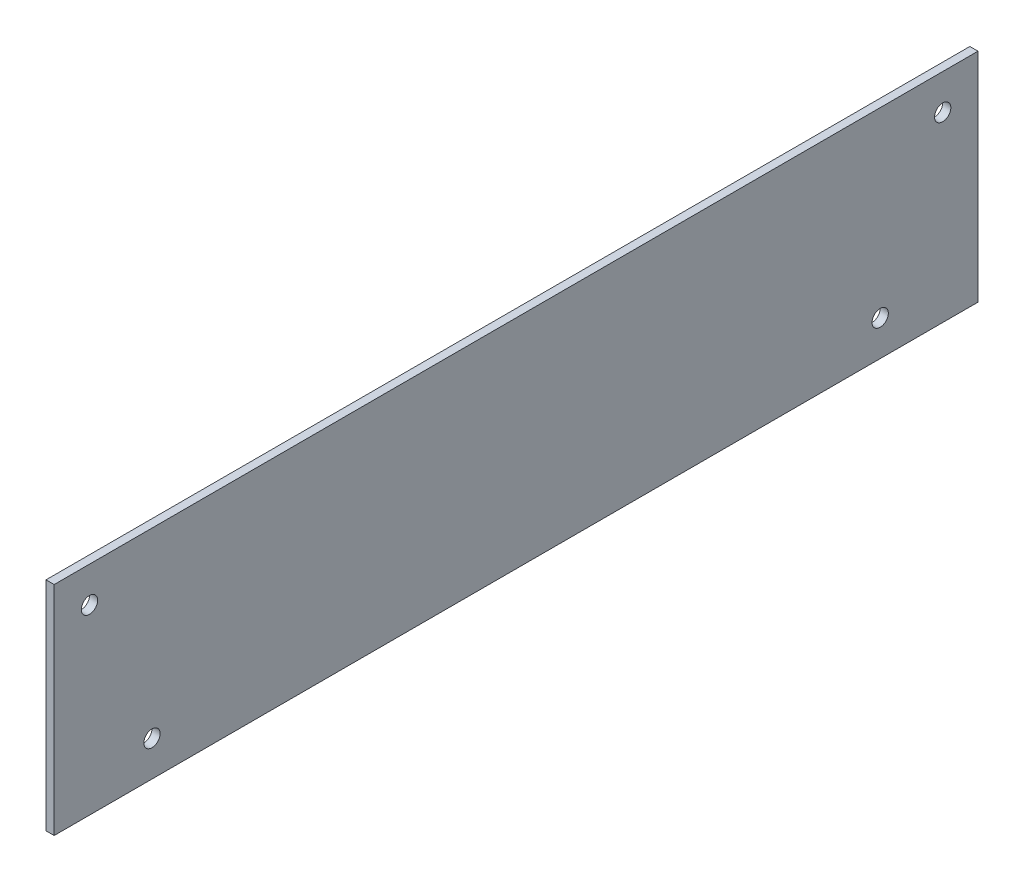
ISO-10303-21;
HEADER;
FILE_DESCRIPTION(('STEP AP214'),'2;1');
FILE_NAME('part.step','',(''),(''),'','','');
FILE_SCHEMA(('AUTOMOTIVE_DESIGN { 1 0 10303 214 1 1 1 1 }'));
ENDSEC;
DATA;
#1=APPLICATION_CONTEXT('core data for automotive mechanical design processes');
#2=APPLICATION_PROTOCOL_DEFINITION('international standard','automotive_design',2000,#1);
#3=PRODUCT_CONTEXT('',#1,'mechanical');
#4=PRODUCT('Part','Part','',(#3));
#5=PRODUCT_RELATED_PRODUCT_CATEGORY('part','',(#4));
#6=PRODUCT_DEFINITION_FORMATION('','',#4);
#7=PRODUCT_DEFINITION_CONTEXT('part definition',#1,'design');
#8=PRODUCT_DEFINITION('design','',#6,#7);
#9=PRODUCT_DEFINITION_SHAPE('','',#8);
#10=(LENGTH_UNIT() NAMED_UNIT(*) SI_UNIT(.MILLI.,.METRE.));
#11=(NAMED_UNIT(*) PLANE_ANGLE_UNIT() SI_UNIT($,.RADIAN.));
#12=(NAMED_UNIT(*) SI_UNIT($,.STERADIAN.) SOLID_ANGLE_UNIT());
#13=UNCERTAINTY_MEASURE_WITH_UNIT(LENGTH_MEASURE(1.E-05),#10,'distance_accuracy_value','');
#14=(GEOMETRIC_REPRESENTATION_CONTEXT(3) GLOBAL_UNCERTAINTY_ASSIGNED_CONTEXT((#13)) GLOBAL_UNIT_ASSIGNED_CONTEXT((#10,
#11,#12)) REPRESENTATION_CONTEXT('',''));
#15=CARTESIAN_POINT('',(0.,0.,0.));
#16=DIRECTION('',(0.,0.,1.));
#17=DIRECTION('',(1.,0.,0.));
#18=AXIS2_PLACEMENT_3D('',#15,#16,#17);
#19=CARTESIAN_POINT('',(1.5,0.,0.));
#20=DIRECTION('',(-1.,0.,0.));
#21=DIRECTION('',(0.,0.,1.));
#22=AXIS2_PLACEMENT_3D('',#19,#20,#21);
#23=PLANE('',#22);
#24=CARTESIAN_POINT('',(1.5,33.5,-163.5));
#25=DIRECTION('',(-1.,0.,0.));
#26=DIRECTION('',(0.,0.,1.));
#27=AXIS2_PLACEMENT_3D('',#24,#25,#26);
#28=CIRCLE('',#27,1.5);
#29=CARTESIAN_POINT('',(1.5,33.5,-162.));
#30=VERTEX_POINT('',#29);
#31=EDGE_CURVE('E114',#30,#30,#28,.F.);
#32=ORIENTED_EDGE('',*,*,#31,.F.);
#33=EDGE_LOOP('',(#32));
#34=FACE_BOUND('',#33,.T.);
#35=CARTESIAN_POINT('',(1.5,6.5,-18.));
#36=DIRECTION('',(-1.,0.,0.));
#37=DIRECTION('',(0.,0.,1.));
#38=AXIS2_PLACEMENT_3D('',#35,#36,#37);
#39=CIRCLE('',#38,1.5);
#40=CARTESIAN_POINT('',(1.5,6.5,-16.5));
#41=VERTEX_POINT('',#40);
#42=EDGE_CURVE('E102',#41,#41,#39,.F.);
#43=ORIENTED_EDGE('',*,*,#42,.F.);
#44=EDGE_LOOP('',(#43));
#45=FACE_BOUND('',#44,.T.);
#46=DIRECTION('',(0.,-1.,0.));
#47=VECTOR('',#46,1.);
#48=CARTESIAN_POINT('',(1.5,0.,0.));
#49=LINE('',#48,#47);
#50=CARTESIAN_POINT('',(1.5,40.,0.));
#51=VERTEX_POINT('',#50);
#52=CARTESIAN_POINT('',(1.5,0.,0.));
#53=VERTEX_POINT('',#52);
#54=EDGE_CURVE('E86',#51,#53,#49,.T.);
#55=ORIENTED_EDGE('',*,*,#54,.T.);
#56=DIRECTION('',(0.,0.,-1.));
#57=VECTOR('',#56,1.);
#58=CARTESIAN_POINT('',(1.5,0.,0.));
#59=LINE('',#58,#57);
#60=CARTESIAN_POINT('',(1.5,0.,-170.));
#61=VERTEX_POINT('',#60);
#62=EDGE_CURVE('E81',#53,#61,#59,.T.);
#63=ORIENTED_EDGE('',*,*,#62,.T.);
#64=DIRECTION('',(0.,1.,0.));
#65=VECTOR('',#64,1.);
#66=CARTESIAN_POINT('',(1.5,0.,-170.));
#67=LINE('',#66,#65);
#68=CARTESIAN_POINT('',(1.5,40.,-170.));
#69=VERTEX_POINT('',#68);
#70=EDGE_CURVE('E84',#61,#69,#67,.T.);
#71=ORIENTED_EDGE('',*,*,#70,.T.);
#72=DIRECTION('',(0.,0.,1.));
#73=VECTOR('',#72,1.);
#74=CARTESIAN_POINT('',(1.5,40.,0.));
#75=LINE('',#74,#73);
#76=EDGE_CURVE('E51',#69,#51,#75,.T.);
#77=ORIENTED_EDGE('',*,*,#76,.T.);
#78=EDGE_LOOP('',(#55,#63,#71,#77));
#79=FACE_BOUND('',#78,.T.);
#80=CARTESIAN_POINT('',(1.5,6.5,-152.));
#81=DIRECTION('',(-1.,0.,0.));
#82=DIRECTION('',(0.,0.,1.));
#83=AXIS2_PLACEMENT_3D('',#80,#81,#82);
#84=CIRCLE('',#83,1.5);
#85=CARTESIAN_POINT('',(1.5,6.5,-150.5));
#86=VERTEX_POINT('',#85);
#87=EDGE_CURVE('E111',#86,#86,#84,.F.);
#88=ORIENTED_EDGE('',*,*,#87,.F.);
#89=EDGE_LOOP('',(#88));
#90=FACE_BOUND('',#89,.T.);
#91=CARTESIAN_POINT('',(1.5,33.5,-6.5));
#92=DIRECTION('',(-1.,0.,0.));
#93=DIRECTION('',(0.,0.,1.));
#94=AXIS2_PLACEMENT_3D('',#91,#92,#93);
#95=CIRCLE('',#94,1.5);
#96=CARTESIAN_POINT('',(1.5,33.5,-5.));
#97=VERTEX_POINT('',#96);
#98=EDGE_CURVE('E117',#97,#97,#95,.F.);
#99=ORIENTED_EDGE('',*,*,#98,.F.);
#100=EDGE_LOOP('',(#99));
#101=FACE_BOUND('',#100,.T.);
#102=ADVANCED_FACE('F32',(#34,#45,#79,#90,#101),#23,.F.);
#103=CARTESIAN_POINT('',(0.,0.,0.));
#104=DIRECTION('',(-1.,0.,0.));
#105=DIRECTION('',(0.,0.,1.));
#106=AXIS2_PLACEMENT_3D('',#103,#104,#105);
#107=PLANE('',#106);
#108=CARTESIAN_POINT('',(0.,33.5,-163.5));
#109=DIRECTION('',(-1.,0.,0.));
#110=DIRECTION('',(0.,0.,1.));
#111=AXIS2_PLACEMENT_3D('',#108,#109,#110);
#112=CIRCLE('',#111,1.5);
#113=CARTESIAN_POINT('',(0.,33.5,-162.));
#114=VERTEX_POINT('',#113);
#115=EDGE_CURVE('E115',#114,#114,#112,.F.);
#116=ORIENTED_EDGE('',*,*,#115,.T.);
#117=EDGE_LOOP('',(#116));
#118=FACE_BOUND('',#117,.T.);
#119=CARTESIAN_POINT('',(0.,6.5,-18.));
#120=DIRECTION('',(-1.,0.,0.));
#121=DIRECTION('',(0.,0.,1.));
#122=AXIS2_PLACEMENT_3D('',#119,#120,#121);
#123=CIRCLE('',#122,1.5);
#124=CARTESIAN_POINT('',(0.,6.5,-16.5));
#125=VERTEX_POINT('',#124);
#126=EDGE_CURVE('E108',#125,#125,#123,.F.);
#127=ORIENTED_EDGE('',*,*,#126,.T.);
#128=EDGE_LOOP('',(#127));
#129=FACE_BOUND('',#128,.T.);
#130=DIRECTION('',(0.,-1.,0.));
#131=VECTOR('',#130,1.);
#132=CARTESIAN_POINT('',(0.,0.,0.));
#133=LINE('',#132,#131);
#134=CARTESIAN_POINT('',(0.,40.,0.));
#135=VERTEX_POINT('',#134);
#136=CARTESIAN_POINT('',(0.,0.,0.));
#137=VERTEX_POINT('',#136);
#138=EDGE_CURVE('E99',#135,#137,#133,.T.);
#139=ORIENTED_EDGE('',*,*,#138,.F.);
#140=DIRECTION('',(0.,0.,1.));
#141=VECTOR('',#140,1.);
#142=CARTESIAN_POINT('',(0.,40.,0.));
#143=LINE('',#142,#141);
#144=CARTESIAN_POINT('',(0.,40.,-170.));
#145=VERTEX_POINT('',#144);
#146=EDGE_CURVE('E74',#145,#135,#143,.T.);
#147=ORIENTED_EDGE('',*,*,#146,.F.);
#148=DIRECTION('',(0.,1.,0.));
#149=VECTOR('',#148,1.);
#150=CARTESIAN_POINT('',(0.,0.,-170.));
#151=LINE('',#150,#149);
#152=CARTESIAN_POINT('',(0.,0.,-170.));
#153=VERTEX_POINT('',#152);
#154=EDGE_CURVE('E68',#153,#145,#151,.T.);
#155=ORIENTED_EDGE('',*,*,#154,.F.);
#156=DIRECTION('',(0.,0.,-1.));
#157=VECTOR('',#156,1.);
#158=CARTESIAN_POINT('',(0.,0.,0.));
#159=LINE('',#158,#157);
#160=EDGE_CURVE('E90',#137,#153,#159,.T.);
#161=ORIENTED_EDGE('',*,*,#160,.F.);
#162=EDGE_LOOP('',(#139,#147,#155,#161));
#163=FACE_BOUND('',#162,.T.);
#164=CARTESIAN_POINT('',(0.,6.5,-152.));
#165=DIRECTION('',(-1.,0.,0.));
#166=DIRECTION('',(0.,0.,1.));
#167=AXIS2_PLACEMENT_3D('',#164,#165,#166);
#168=CIRCLE('',#167,1.5);
#169=CARTESIAN_POINT('',(0.,6.5,-150.5));
#170=VERTEX_POINT('',#169);
#171=EDGE_CURVE('E112',#170,#170,#168,.F.);
#172=ORIENTED_EDGE('',*,*,#171,.T.);
#173=EDGE_LOOP('',(#172));
#174=FACE_BOUND('',#173,.T.);
#175=CARTESIAN_POINT('',(0.,33.5,-6.5));
#176=DIRECTION('',(-1.,0.,0.));
#177=DIRECTION('',(0.,0.,1.));
#178=AXIS2_PLACEMENT_3D('',#175,#176,#177);
#179=CIRCLE('',#178,1.5);
#180=CARTESIAN_POINT('',(0.,33.5,-5.));
#181=VERTEX_POINT('',#180);
#182=EDGE_CURVE('E36',#181,#181,#179,.F.);
#183=ORIENTED_EDGE('',*,*,#182,.T.);
#184=EDGE_LOOP('',(#183));
#185=FACE_BOUND('',#184,.T.);
#186=ADVANCED_FACE('F136',(#118,#129,#163,#174,#185),#107,.T.);
#187=CARTESIAN_POINT('',(1.5,0.,0.));
#188=DIRECTION('',(0.,0.,-1.));
#189=DIRECTION('',(-1.,0.,0.));
#190=AXIS2_PLACEMENT_3D('',#187,#188,#189);
#191=PLANE('',#190);
#192=ORIENTED_EDGE('',*,*,#138,.T.);
#193=DIRECTION('',(-1.,0.,0.));
#194=VECTOR('',#193,1.);
#195=CARTESIAN_POINT('',(1.5,0.,0.));
#196=LINE('',#195,#194);
#197=EDGE_CURVE('E11',#53,#137,#196,.T.);
#198=ORIENTED_EDGE('',*,*,#197,.F.);
#199=ORIENTED_EDGE('',*,*,#54,.F.);
#200=DIRECTION('',(-1.,0.,0.));
#201=VECTOR('',#200,1.);
#202=CARTESIAN_POINT('',(1.5,40.,0.));
#203=LINE('',#202,#201);
#204=EDGE_CURVE('E95',#51,#135,#203,.T.);
#205=ORIENTED_EDGE('',*,*,#204,.T.);
#206=EDGE_LOOP('',(#192,#198,#199,#205));
#207=FACE_BOUND('',#206,.T.);
#208=ADVANCED_FACE('F34',(#207),#191,.F.);
#209=CARTESIAN_POINT('',(1.5,0.,0.));
#210=DIRECTION('',(0.,1.,0.));
#211=DIRECTION('',(0.,0.,1.));
#212=AXIS2_PLACEMENT_3D('',#209,#210,#211);
#213=PLANE('',#212);
#214=ORIENTED_EDGE('',*,*,#160,.T.);
#215=DIRECTION('',(-1.,0.,0.));
#216=VECTOR('',#215,1.);
#217=CARTESIAN_POINT('',(1.5,0.,-170.));
#218=LINE('',#217,#216);
#219=EDGE_CURVE('E42',#61,#153,#218,.T.);
#220=ORIENTED_EDGE('',*,*,#219,.F.);
#221=ORIENTED_EDGE('',*,*,#62,.F.);
#222=ORIENTED_EDGE('',*,*,#197,.T.);
#223=EDGE_LOOP('',(#214,#220,#221,#222));
#224=FACE_BOUND('',#223,.T.);
#225=ADVANCED_FACE('F89',(#224),#213,.F.);
#226=CARTESIAN_POINT('',(1.5,0.,-170.));
#227=DIRECTION('',(0.,0.,1.));
#228=DIRECTION('',(1.,0.,0.));
#229=AXIS2_PLACEMENT_3D('',#226,#227,#228);
#230=PLANE('',#229);
#231=ORIENTED_EDGE('',*,*,#154,.T.);
#232=DIRECTION('',(-1.,0.,0.));
#233=VECTOR('',#232,1.);
#234=CARTESIAN_POINT('',(1.5,40.,-170.));
#235=LINE('',#234,#233);
#236=EDGE_CURVE('E91',#69,#145,#235,.T.);
#237=ORIENTED_EDGE('',*,*,#236,.F.);
#238=ORIENTED_EDGE('',*,*,#70,.F.);
#239=ORIENTED_EDGE('',*,*,#219,.T.);
#240=EDGE_LOOP('',(#231,#237,#238,#239));
#241=FACE_BOUND('',#240,.T.);
#242=ADVANCED_FACE('F93',(#241),#230,.F.);
#243=CARTESIAN_POINT('',(1.5,40.,0.));
#244=DIRECTION('',(0.,-1.,0.));
#245=DIRECTION('',(0.,0.,-1.));
#246=AXIS2_PLACEMENT_3D('',#243,#244,#245);
#247=PLANE('',#246);
#248=ORIENTED_EDGE('',*,*,#146,.T.);
#249=ORIENTED_EDGE('',*,*,#204,.F.);
#250=ORIENTED_EDGE('',*,*,#76,.F.);
#251=ORIENTED_EDGE('',*,*,#236,.T.);
#252=EDGE_LOOP('',(#248,#249,#250,#251));
#253=FACE_BOUND('',#252,.T.);
#254=ADVANCED_FACE('F148',(#253),#247,.F.);
#255=CARTESIAN_POINT('',(16.5,6.5,-18.));
#256=DIRECTION('',(-1.,0.,0.));
#257=DIRECTION('',(0.,0.,1.));
#258=AXIS2_PLACEMENT_3D('',#255,#256,#257);
#259=CYLINDRICAL_SURFACE('',#258,1.5);
#260=ORIENTED_EDGE('',*,*,#126,.F.);
#261=EDGE_LOOP('',(#260));
#262=FACE_BOUND('',#261,.T.);
#263=ORIENTED_EDGE('',*,*,#42,.T.);
#264=EDGE_LOOP('',(#263));
#265=FACE_BOUND('',#264,.T.);
#266=ADVANCED_FACE('F133',(#262,#265),#259,.F.);
#267=CARTESIAN_POINT('',(16.5,6.5,-152.));
#268=DIRECTION('',(-1.,0.,0.));
#269=DIRECTION('',(0.,0.,1.));
#270=AXIS2_PLACEMENT_3D('',#267,#268,#269);
#271=CYLINDRICAL_SURFACE('',#270,1.5);
#272=ORIENTED_EDGE('',*,*,#171,.F.);
#273=EDGE_LOOP('',(#272));
#274=FACE_BOUND('',#273,.T.);
#275=ORIENTED_EDGE('',*,*,#87,.T.);
#276=EDGE_LOOP('',(#275));
#277=FACE_BOUND('',#276,.T.);
#278=ADVANCED_FACE('F173',(#274,#277),#271,.F.);
#279=CARTESIAN_POINT('',(16.5,33.5,-163.5));
#280=DIRECTION('',(-1.,0.,0.));
#281=DIRECTION('',(0.,0.,1.));
#282=AXIS2_PLACEMENT_3D('',#279,#280,#281);
#283=CYLINDRICAL_SURFACE('',#282,1.5);
#284=ORIENTED_EDGE('',*,*,#115,.F.);
#285=EDGE_LOOP('',(#284));
#286=FACE_BOUND('',#285,.T.);
#287=ORIENTED_EDGE('',*,*,#31,.T.);
#288=EDGE_LOOP('',(#287));
#289=FACE_BOUND('',#288,.T.);
#290=ADVANCED_FACE('F168',(#286,#289),#283,.F.);
#291=CARTESIAN_POINT('',(16.5,33.5,-6.5));
#292=DIRECTION('',(-1.,0.,0.));
#293=DIRECTION('',(0.,0.,1.));
#294=AXIS2_PLACEMENT_3D('',#291,#292,#293);
#295=CYLINDRICAL_SURFACE('',#294,1.5);
#296=ORIENTED_EDGE('',*,*,#182,.F.);
#297=EDGE_LOOP('',(#296));
#298=FACE_BOUND('',#297,.T.);
#299=ORIENTED_EDGE('',*,*,#98,.T.);
#300=EDGE_LOOP('',(#299));
#301=FACE_BOUND('',#300,.T.);
#302=ADVANCED_FACE('F166',(#298,#301),#295,.F.);
#303=CLOSED_SHELL('',(#102,#186,#208,#225,#242,#254,#266,#278,#290,#302));
#304=MANIFOLD_SOLID_BREP('B2',#303);
#305=ADVANCED_BREP_SHAPE_REPRESENTATION('',(#18,#304),#14);
#306=SHAPE_DEFINITION_REPRESENTATION(#9,#305);
ENDSEC;
END-ISO-10303-21;
